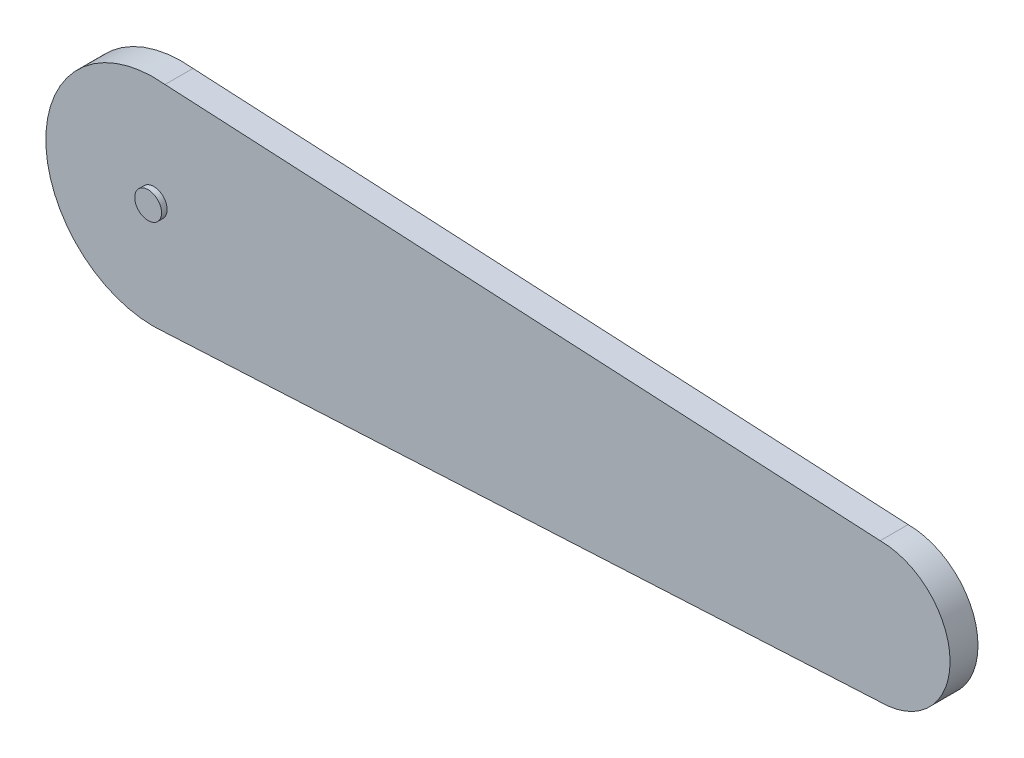
ISO-10303-21;
HEADER;
FILE_DESCRIPTION(('STEP AP214'),'2;1');
FILE_NAME('part.step','',(''),(''),'','','');
FILE_SCHEMA(('AUTOMOTIVE_DESIGN { 1 0 10303 214 1 1 1 1 }'));
ENDSEC;
DATA;
#1=APPLICATION_CONTEXT('core data for automotive mechanical design processes');
#2=APPLICATION_PROTOCOL_DEFINITION('international standard','automotive_design',2000,#1);
#3=PRODUCT_CONTEXT('',#1,'mechanical');
#4=PRODUCT('Part','Part','',(#3));
#5=PRODUCT_RELATED_PRODUCT_CATEGORY('part','',(#4));
#6=PRODUCT_DEFINITION_FORMATION('','',#4);
#7=PRODUCT_DEFINITION_CONTEXT('part definition',#1,'design');
#8=PRODUCT_DEFINITION('design','',#6,#7);
#9=PRODUCT_DEFINITION_SHAPE('','',#8);
#10=(LENGTH_UNIT() NAMED_UNIT(*) SI_UNIT(.MILLI.,.METRE.));
#11=(NAMED_UNIT(*) PLANE_ANGLE_UNIT() SI_UNIT($,.RADIAN.));
#12=(NAMED_UNIT(*) SI_UNIT($,.STERADIAN.) SOLID_ANGLE_UNIT());
#13=UNCERTAINTY_MEASURE_WITH_UNIT(LENGTH_MEASURE(1.E-05),#10,'distance_accuracy_value','');
#14=(GEOMETRIC_REPRESENTATION_CONTEXT(3) GLOBAL_UNCERTAINTY_ASSIGNED_CONTEXT((#13)) GLOBAL_UNIT_ASSIGNED_CONTEXT((#10,
#11,#12)) REPRESENTATION_CONTEXT('',''));
#15=CARTESIAN_POINT('',(0.,0.,0.));
#16=DIRECTION('',(0.,0.,1.));
#17=DIRECTION('',(1.,0.,0.));
#18=AXIS2_PLACEMENT_3D('',#15,#16,#17);
#19=CARTESIAN_POINT('',(172.206401762203,148.260309011849,0.));
#20=DIRECTION('',(0.,0.,-1.));
#21=DIRECTION('',(1.,0.,0.));
#22=AXIS2_PLACEMENT_3D('',#19,#20,#21);
#23=CYLINDRICAL_SURFACE('',#22,2.4);
#24=CARTESIAN_POINT('',(172.206401762203,148.260309011849,1.));
#25=DIRECTION('',(0.,0.,1.));
#26=DIRECTION('',(-1.,0.,0.));
#27=AXIS2_PLACEMENT_3D('',#24,#25,#26);
#28=CIRCLE('',#27,2.4);
#29=CARTESIAN_POINT('',(169.806401762203,148.260309011849,1.));
#30=VERTEX_POINT('',#29);
#31=EDGE_CURVE('P0_E27',#30,#30,#28,.T.);
#32=ORIENTED_EDGE('',*,*,#31,.F.);
#33=EDGE_LOOP('',(#32));
#34=FACE_BOUND('',#33,.T.);
#35=CARTESIAN_POINT('',(172.206401762203,148.260309011849,0.));
#36=DIRECTION('',(0.,0.,1.));
#37=DIRECTION('',(1.,0.,0.));
#38=AXIS2_PLACEMENT_3D('',#35,#36,#37);
#39=CIRCLE('',#38,2.4);
#40=CARTESIAN_POINT('',(169.806401762203,148.260309011849,0.));
#41=VERTEX_POINT('',#40);
#42=EDGE_CURVE('P0_E11',#41,#41,#39,.T.);
#43=ORIENTED_EDGE('',*,*,#42,.T.);
#44=EDGE_LOOP('',(#43));
#45=FACE_BOUND('',#44,.T.);
#46=ADVANCED_FACE('P0_F17',(#34,#45),#23,.T.);
#47=CARTESIAN_POINT('',(172.206401762203,148.260309011849,1.));
#48=DIRECTION('',(0.,0.,1.));
#49=DIRECTION('',(1.,0.,0.));
#50=AXIS2_PLACEMENT_3D('',#47,#48,#49);
#51=PLANE('',#50);
#52=ORIENTED_EDGE('',*,*,#31,.T.);
#53=EDGE_LOOP('',(#52));
#54=FACE_BOUND('',#53,.T.);
#55=ADVANCED_FACE('P0_F35',(#54),#51,.T.);
#56=CARTESIAN_POINT('',(172.206401762203,148.260309011849,0.));
#57=DIRECTION('',(0.,0.,1.));
#58=DIRECTION('',(1.,0.,0.));
#59=AXIS2_PLACEMENT_3D('',#56,#57,#58);
#60=PLANE('',#59);
#61=ORIENTED_EDGE('',*,*,#42,.F.);
#62=EDGE_LOOP('',(#61));
#63=FACE_BOUND('',#62,.T.);
#64=ADVANCED_FACE('P0_F19',(#63),#60,.F.);
#65=CLOSED_SHELL('',(#46,#55,#64));
#66=MANIFOLD_SOLID_BREP('P0_B1',#65);
#67=CARTESIAN_POINT('',(302.206401762203,148.260309011849,0.));
#68=DIRECTION('',(0.,0.,1.));
#69=DIRECTION('',(-1.,0.,0.));
#70=AXIS2_PLACEMENT_3D('',#67,#68,#69);
#71=CYLINDRICAL_SURFACE('',#70,2.4);
#72=CARTESIAN_POINT('',(302.206401762203,148.260309011849,0.));
#73=DIRECTION('',(0.,0.,1.));
#74=DIRECTION('',(-1.,0.,0.));
#75=AXIS2_PLACEMENT_3D('',#72,#73,#74);
#76=CIRCLE('',#75,2.4);
#77=CARTESIAN_POINT('',(304.606401762203,148.260309011849,0.));
#78=VERTEX_POINT('',#77);
#79=EDGE_CURVE('P1_E27',#78,#78,#76,.T.);
#80=ORIENTED_EDGE('',*,*,#79,.F.);
#81=DIRECTION('',(0.,0.,-1.));
#82=VECTOR('',#81,1.);
#83=CARTESIAN_POINT('',(304.606401762203,148.260309011849,0.));
#84=LINE('',#83,#82);
#85=CARTESIAN_POINT('',(304.606401762203,148.260309011849,-1.00000000000003));
#86=VERTEX_POINT('',#85);
#87=EDGE_CURVE('P1_E11',#78,#86,#84,.T.);
#88=ORIENTED_EDGE('',*,*,#87,.T.);
#89=CARTESIAN_POINT('',(302.206401762203,148.260309011849,-1.00000000000003));
#90=DIRECTION('',(0.,0.,-1.));
#91=DIRECTION('',(-1.,0.,0.));
#92=AXIS2_PLACEMENT_3D('',#89,#90,#91);
#93=CIRCLE('',#92,2.4);
#94=EDGE_CURVE('P1_E34',#86,#86,#93,.T.);
#95=ORIENTED_EDGE('',*,*,#94,.F.);
#96=ORIENTED_EDGE('',*,*,#87,.F.);
#97=EDGE_LOOP('',(#80,#88,#95,#96));
#98=FACE_BOUND('',#97,.T.);
#99=ADVANCED_FACE('P1_F17',(#98),#71,.T.);
#100=CARTESIAN_POINT('',(302.206401762204,148.260309011849,0.));
#101=DIRECTION('',(0.,0.,1.));
#102=DIRECTION('',(1.,0.,0.));
#103=AXIS2_PLACEMENT_3D('',#100,#101,#102);
#104=PLANE('',#103);
#105=ORIENTED_EDGE('',*,*,#79,.T.);
#106=EDGE_LOOP('',(#105));
#107=FACE_BOUND('',#106,.T.);
#108=ADVANCED_FACE('P1_F19',(#107),#104,.T.);
#109=CARTESIAN_POINT('',(302.206401762204,148.260309011849,-1.00000000000003));
#110=DIRECTION('',(0.,0.,1.));
#111=DIRECTION('',(1.,0.,0.));
#112=AXIS2_PLACEMENT_3D('',#109,#110,#111);
#113=PLANE('',#112);
#114=ORIENTED_EDGE('',*,*,#94,.T.);
#115=EDGE_LOOP('',(#114));
#116=FACE_BOUND('',#115,.T.);
#117=ADVANCED_FACE('P1_F44',(#116),#113,.F.);
#118=CLOSED_SHELL('',(#99,#108,#117));
#119=MANIFOLD_SOLID_BREP('P1_B1',#118);
#120=CARTESIAN_POINT('',(302.206401762203,148.260309011849,-1.));
#121=DIRECTION('',(0.,0.,1.));
#122=DIRECTION('',(1.,0.,0.));
#123=AXIS2_PLACEMENT_3D('',#120,#121,#122);
#124=CYLINDRICAL_SURFACE('',#123,2.4);
#125=CARTESIAN_POINT('',(302.206401762203,148.260309011849,-6.));
#126=DIRECTION('',(0.,0.,-1.));
#127=DIRECTION('',(-1.,0.,0.));
#128=AXIS2_PLACEMENT_3D('',#125,#126,#127);
#129=CIRCLE('',#128,2.4);
#130=CARTESIAN_POINT('',(304.606401762203,148.260309011849,-6.));
#131=VERTEX_POINT('',#130);
#132=EDGE_CURVE('P2_E20',#131,#131,#129,.T.);
#133=ORIENTED_EDGE('',*,*,#132,.F.);
#134=EDGE_LOOP('',(#133));
#135=FACE_BOUND('',#134,.T.);
#136=CARTESIAN_POINT('',(302.206401762203,148.260309011849,-1.));
#137=DIRECTION('',(0.,0.,1.));
#138=DIRECTION('',(1.,0.,0.));
#139=AXIS2_PLACEMENT_3D('',#136,#137,#138);
#140=CIRCLE('',#139,2.4);
#141=CARTESIAN_POINT('',(304.606401762203,148.260309011849,-1.));
#142=VERTEX_POINT('',#141);
#143=EDGE_CURVE('P2_E11',#142,#142,#140,.T.);
#144=ORIENTED_EDGE('',*,*,#143,.F.);
#145=EDGE_LOOP('',(#144));
#146=FACE_BOUND('',#145,.T.);
#147=ADVANCED_FACE('P2_F17',(#135,#146),#124,.T.);
#148=CARTESIAN_POINT('',(302.206401762203,148.260309011849,-1.));
#149=DIRECTION('',(0.,0.,1.));
#150=DIRECTION('',(1.,0.,0.));
#151=AXIS2_PLACEMENT_3D('',#148,#149,#150);
#152=PLANE('',#151);
#153=ORIENTED_EDGE('',*,*,#143,.T.);
#154=EDGE_LOOP('',(#153));
#155=FACE_BOUND('',#154,.T.);
#156=ADVANCED_FACE('P2_F33',(#155),#152,.T.);
#157=CARTESIAN_POINT('',(302.206401762203,148.260309011849,-6.));
#158=DIRECTION('',(0.,0.,1.));
#159=DIRECTION('',(1.,0.,0.));
#160=AXIS2_PLACEMENT_3D('',#157,#158,#159);
#161=PLANE('',#160);
#162=ORIENTED_EDGE('',*,*,#132,.T.);
#163=EDGE_LOOP('',(#162));
#164=FACE_BOUND('',#163,.T.);
#165=ADVANCED_FACE('P2_F35',(#164),#161,.F.);
#166=CLOSED_SHELL('',(#147,#156,#165));
#167=MANIFOLD_SOLID_BREP('P2_B1',#166);
#168=CARTESIAN_POINT('',(302.206401762203,148.260309011849,0.));
#169=DIRECTION('',(0.,0.,1.));
#170=DIRECTION('',(0.,-1.,0.));
#171=AXIS2_PLACEMENT_3D('',#168,#169,#170);
#172=CYLINDRICAL_SURFACE('',#171,12.5);
#173=CARTESIAN_POINT('',(302.206401762203,148.260309011849,0.));
#174=DIRECTION('',(0.,0.,1.));
#175=DIRECTION('',(0.,-1.,0.));
#176=AXIS2_PLACEMENT_3D('',#173,#174,#175);
#177=CIRCLE('',#176,12.5);
#178=CARTESIAN_POINT('',(302.206401762203,135.760309011849,0.));
#179=VERTEX_POINT('',#178);
#180=CARTESIAN_POINT('',(302.206401762203,160.760309011849,0.));
#181=VERTEX_POINT('',#180);
#182=EDGE_CURVE('P3_E36',#179,#181,#177,.T.);
#183=ORIENTED_EDGE('',*,*,#182,.F.);
#184=DIRECTION('',(0.,0.,-1.));
#185=VECTOR('',#184,1.);
#186=CARTESIAN_POINT('',(302.206401762203,135.760309011849,0.));
#187=LINE('',#186,#185);
#188=CARTESIAN_POINT('',(302.206401762203,135.760309011849,-5.));
#189=VERTEX_POINT('',#188);
#190=EDGE_CURVE('P3_E11',#179,#189,#187,.T.);
#191=ORIENTED_EDGE('',*,*,#190,.T.);
#192=CARTESIAN_POINT('',(302.206401762203,148.260309011849,-5.));
#193=DIRECTION('',(0.,0.,-1.));
#194=DIRECTION('',(0.,-1.,0.));
#195=AXIS2_PLACEMENT_3D('',#192,#193,#194);
#196=CIRCLE('',#195,12.5);
#197=CARTESIAN_POINT('',(302.206401762203,160.760309011849,-5.));
#198=VERTEX_POINT('',#197);
#199=EDGE_CURVE('P3_E64',#198,#189,#196,.T.);
#200=ORIENTED_EDGE('',*,*,#199,.F.);
#201=DIRECTION('',(0.,0.,-1.));
#202=VECTOR('',#201,1.);
#203=CARTESIAN_POINT('',(302.206401762203,160.760309011849,0.));
#204=LINE('',#203,#202);
#205=EDGE_CURVE('P3_E28',#181,#198,#204,.T.);
#206=ORIENTED_EDGE('',*,*,#205,.F.);
#207=EDGE_LOOP('',(#183,#191,#200,#206));
#208=FACE_BOUND('',#207,.T.);
#209=ADVANCED_FACE('P3_F17',(#208),#172,.T.);
#210=CARTESIAN_POINT('',(174.225161155172,167.467521621952,0.));
#211=DIRECTION('',(0.0523359562429438,0.998629534754574,0.));
#212=DIRECTION('',(0.998629534754574,-0.0523359562429438,0.));
#213=AXIS2_PLACEMENT_3D('',#210,#211,#212);
#214=PLANE('',#213);
#215=DIRECTION('',(-0.998629534754574,0.0523359562429455,0.));
#216=VECTOR('',#215,1.);
#217=CARTESIAN_POINT('',(302.206401762203,160.760309011849,0.));
#218=LINE('',#217,#216);
#219=CARTESIAN_POINT('',(174.225161155172,167.467521621952,0.));
#220=VERTEX_POINT('',#219);
#221=EDGE_CURVE('P3_E57',#181,#220,#218,.T.);
#222=ORIENTED_EDGE('',*,*,#221,.F.);
#223=ORIENTED_EDGE('',*,*,#205,.T.);
#224=DIRECTION('',(0.998629534754574,-0.0523359562429455,0.));
#225=VECTOR('',#224,1.);
#226=CARTESIAN_POINT('',(302.206401762203,160.760309011849,-5.));
#227=LINE('',#226,#225);
#228=CARTESIAN_POINT('',(174.225161155172,167.467521621952,-5.));
#229=VERTEX_POINT('',#228);
#230=EDGE_CURVE('P3_E100',#229,#198,#227,.T.);
#231=ORIENTED_EDGE('',*,*,#230,.F.);
#232=DIRECTION('',(0.,0.,-1.));
#233=VECTOR('',#232,1.);
#234=CARTESIAN_POINT('',(174.225161155172,167.467521621952,0.));
#235=LINE('',#234,#233);
#236=EDGE_CURVE('P3_E68',#220,#229,#235,.T.);
#237=ORIENTED_EDGE('',*,*,#236,.F.);
#238=EDGE_LOOP('',(#222,#223,#231,#237));
#239=FACE_BOUND('',#238,.T.);
#240=ADVANCED_FACE('P3_F70',(#239),#214,.T.);
#241=CARTESIAN_POINT('',(172.206401762204,148.260309011849,0.));
#242=DIRECTION('',(0.,0.,1.));
#243=DIRECTION('',(0.104528463267588,0.99452189536828,0.));
#244=AXIS2_PLACEMENT_3D('',#241,#242,#243);
#245=CYLINDRICAL_SURFACE('',#244,19.3130113067953);
#246=CARTESIAN_POINT('',(172.206401762204,148.260309011849,0.));
#247=DIRECTION('',(0.,0.,1.));
#248=DIRECTION('',(0.104528463267588,0.99452189536828,0.));
#249=AXIS2_PLACEMENT_3D('',#246,#247,#248);
#250=CIRCLE('',#249,19.3130113067953);
#251=CARTESIAN_POINT('',(174.225161155173,129.053096401746,0.));
#252=VERTEX_POINT('',#251);
#253=EDGE_CURVE('P3_E74',#220,#252,#250,.T.);
#254=ORIENTED_EDGE('',*,*,#253,.F.);
#255=ORIENTED_EDGE('',*,*,#236,.T.);
#256=CARTESIAN_POINT('',(172.206401762204,148.260309011849,-5.));
#257=DIRECTION('',(0.,0.,-1.));
#258=DIRECTION('',(0.104528463267588,0.99452189536828,0.));
#259=AXIS2_PLACEMENT_3D('',#256,#257,#258);
#260=CIRCLE('',#259,19.3130113067953);
#261=CARTESIAN_POINT('',(174.225161155173,129.053096401746,-5.));
#262=VERTEX_POINT('',#261);
#263=EDGE_CURVE('P3_E21',#262,#229,#260,.T.);
#264=ORIENTED_EDGE('',*,*,#263,.F.);
#265=DIRECTION('',(0.,0.,-1.));
#266=VECTOR('',#265,1.);
#267=CARTESIAN_POINT('',(174.225161155173,129.053096401746,0.));
#268=LINE('',#267,#266);
#269=EDGE_CURVE('P3_E87',#252,#262,#268,.T.);
#270=ORIENTED_EDGE('',*,*,#269,.F.);
#271=EDGE_LOOP('',(#254,#255,#264,#270));
#272=FACE_BOUND('',#271,.T.);
#273=ADVANCED_FACE('P3_F96',(#272),#245,.T.);
#274=CARTESIAN_POINT('',(302.206401762203,135.760309011849,0.));
#275=DIRECTION('',(0.0523359562429436,-0.998629534754574,0.));
#276=DIRECTION('',(-0.998629534754574,-0.0523359562429436,0.));
#277=AXIS2_PLACEMENT_3D('',#274,#275,#276);
#278=PLANE('',#277);
#279=DIRECTION('',(0.998629534754574,0.0523359562429437,0.));
#280=VECTOR('',#279,1.);
#281=CARTESIAN_POINT('',(174.225161155173,129.053096401746,0.));
#282=LINE('',#281,#280);
#283=EDGE_CURVE('P3_E60',#252,#179,#282,.T.);
#284=ORIENTED_EDGE('',*,*,#283,.F.);
#285=ORIENTED_EDGE('',*,*,#269,.T.);
#286=DIRECTION('',(-0.998629534754574,-0.0523359562429437,0.));
#287=VECTOR('',#286,1.);
#288=CARTESIAN_POINT('',(174.225161155173,129.053096401746,-5.));
#289=LINE('',#288,#287);
#290=EDGE_CURVE('P3_E79',#189,#262,#289,.T.);
#291=ORIENTED_EDGE('',*,*,#290,.F.);
#292=ORIENTED_EDGE('',*,*,#190,.F.);
#293=EDGE_LOOP('',(#284,#285,#291,#292));
#294=FACE_BOUND('',#293,.T.);
#295=ADVANCED_FACE('P3_F109',(#294),#278,.T.);
#296=CARTESIAN_POINT('',(233.306013650101,148.260309011849,0.));
#297=DIRECTION('',(0.,0.,1.));
#298=DIRECTION('',(1.,0.,0.));
#299=AXIS2_PLACEMENT_3D('',#296,#297,#298);
#300=PLANE('',#299);
#301=ORIENTED_EDGE('',*,*,#283,.T.);
#302=ORIENTED_EDGE('',*,*,#182,.T.);
#303=ORIENTED_EDGE('',*,*,#221,.T.);
#304=ORIENTED_EDGE('',*,*,#253,.T.);
#305=EDGE_LOOP('',(#301,#302,#303,#304));
#306=FACE_BOUND('',#305,.T.);
#307=ADVANCED_FACE('P3_F19',(#306),#300,.T.);
#308=CARTESIAN_POINT('',(233.306013650101,148.260309011849,-5.));
#309=DIRECTION('',(0.,0.,1.));
#310=DIRECTION('',(1.,0.,0.));
#311=AXIS2_PLACEMENT_3D('',#308,#309,#310);
#312=PLANE('',#311);
#313=ORIENTED_EDGE('',*,*,#290,.T.);
#314=ORIENTED_EDGE('',*,*,#263,.T.);
#315=ORIENTED_EDGE('',*,*,#230,.T.);
#316=ORIENTED_EDGE('',*,*,#199,.T.);
#317=EDGE_LOOP('',(#313,#314,#315,#316));
#318=FACE_BOUND('',#317,.T.);
#319=ADVANCED_FACE('P3_F99',(#318),#312,.F.);
#320=CLOSED_SHELL('',(#209,#240,#273,#295,#307,#319));
#321=MANIFOLD_SOLID_BREP('P3_B1',#320);
#322=ADVANCED_BREP_SHAPE_REPRESENTATION('',(#18,#66,#119,#167,#321),#14);
#323=SHAPE_DEFINITION_REPRESENTATION(#9,#322);
ENDSEC;
END-ISO-10303-21;
